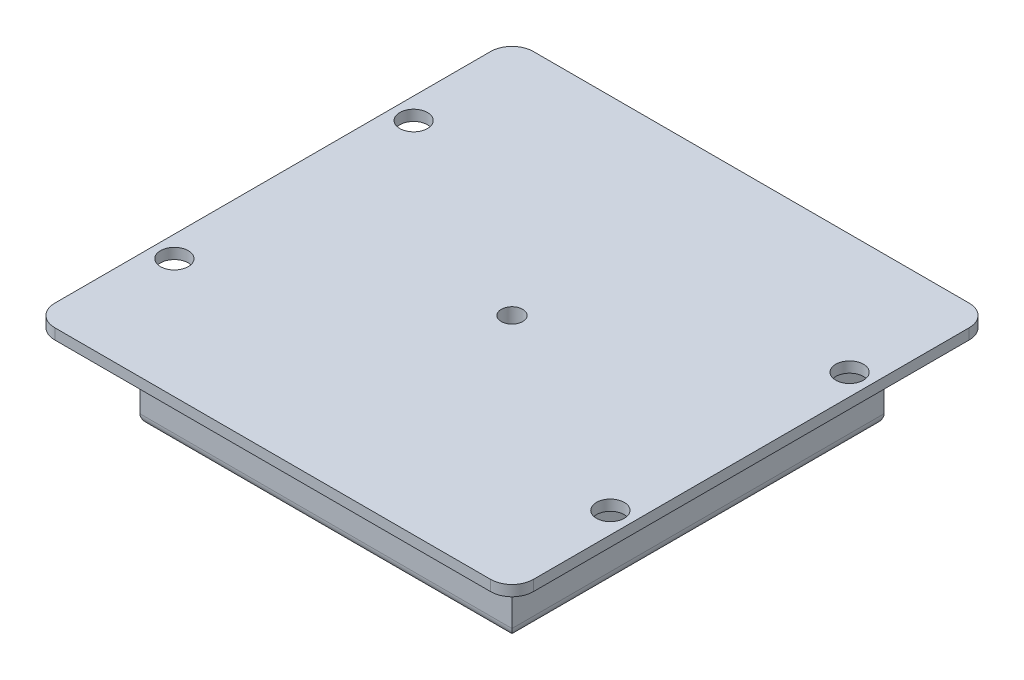
ISO-10303-21;
HEADER;
FILE_DESCRIPTION(('STEP AP214'),'2;1');
FILE_NAME('part.step','',(''),(''),'','','');
FILE_SCHEMA(('AUTOMOTIVE_DESIGN { 1 0 10303 214 1 1 1 1 }'));
ENDSEC;
DATA;
#1=APPLICATION_CONTEXT('core data for automotive mechanical design processes');
#2=APPLICATION_PROTOCOL_DEFINITION('international standard','automotive_design',2000,#1);
#3=PRODUCT_CONTEXT('',#1,'mechanical');
#4=PRODUCT('Part','Part','',(#3));
#5=PRODUCT_RELATED_PRODUCT_CATEGORY('part','',(#4));
#6=PRODUCT_DEFINITION_FORMATION('','',#4);
#7=PRODUCT_DEFINITION_CONTEXT('part definition',#1,'design');
#8=PRODUCT_DEFINITION('design','',#6,#7);
#9=PRODUCT_DEFINITION_SHAPE('','',#8);
#10=(LENGTH_UNIT() NAMED_UNIT(*) SI_UNIT(.MILLI.,.METRE.));
#11=(NAMED_UNIT(*) PLANE_ANGLE_UNIT() SI_UNIT($,.RADIAN.));
#12=(NAMED_UNIT(*) SI_UNIT($,.STERADIAN.) SOLID_ANGLE_UNIT());
#13=UNCERTAINTY_MEASURE_WITH_UNIT(LENGTH_MEASURE(1.E-05),#10,'distance_accuracy_value','');
#14=(GEOMETRIC_REPRESENTATION_CONTEXT(3) GLOBAL_UNCERTAINTY_ASSIGNED_CONTEXT((#13)) GLOBAL_UNIT_ASSIGNED_CONTEXT((#10,
#11,#12)) REPRESENTATION_CONTEXT('',''));
#15=CARTESIAN_POINT('',(0.,0.,0.));
#16=DIRECTION('',(0.,0.,1.));
#17=DIRECTION('',(1.,0.,0.));
#18=AXIS2_PLACEMENT_3D('',#15,#16,#17);
#19=CARTESIAN_POINT('',(0.,0.,0.));
#20=DIRECTION('',(0.,-1.,0.));
#21=DIRECTION('',(0.,0.,-1.));
#22=AXIS2_PLACEMENT_3D('',#19,#20,#21);
#23=PLANE('',#22);
#24=CARTESIAN_POINT('',(-52.07,0.,28.575));
#25=DIRECTION('',(0.,-1.,0.));
#26=DIRECTION('',(0.,0.,-1.));
#27=AXIS2_PLACEMENT_3D('',#24,#25,#26);
#28=CIRCLE('',#27,3.31469999999999);
#29=CARTESIAN_POINT('',(-52.07,0.,25.2603));
#30=VERTEX_POINT('',#29);
#31=EDGE_CURVE('E209',#30,#30,#28,.T.);
#32=ORIENTED_EDGE('',*,*,#31,.F.);
#33=EDGE_LOOP('',(#32));
#34=FACE_BOUND('',#33,.T.);
#35=CARTESIAN_POINT('',(-52.07,0.,-28.575));
#36=DIRECTION('',(0.,-1.,0.));
#37=DIRECTION('',(0.,0.,-1.));
#38=AXIS2_PLACEMENT_3D('',#35,#36,#37);
#39=CIRCLE('',#38,3.31469999999999);
#40=CARTESIAN_POINT('',(-52.07,0.,-31.8897));
#41=VERTEX_POINT('',#40);
#42=EDGE_CURVE('E216',#41,#41,#39,.T.);
#43=ORIENTED_EDGE('',*,*,#42,.F.);
#44=EDGE_LOOP('',(#43));
#45=FACE_BOUND('',#44,.T.);
#46=CARTESIAN_POINT('',(52.07,0.,28.575));
#47=DIRECTION('',(0.,-1.,0.));
#48=DIRECTION('',(0.,0.,-1.));
#49=AXIS2_PLACEMENT_3D('',#46,#47,#48);
#50=CIRCLE('',#49,3.31469999999999);
#51=CARTESIAN_POINT('',(52.07,0.,25.2603));
#52=VERTEX_POINT('',#51);
#53=EDGE_CURVE('E222',#52,#52,#50,.T.);
#54=ORIENTED_EDGE('',*,*,#53,.F.);
#55=EDGE_LOOP('',(#54));
#56=FACE_BOUND('',#55,.T.);
#57=CARTESIAN_POINT('',(52.07,0.,-28.575));
#58=DIRECTION('',(0.,-1.,0.));
#59=DIRECTION('',(0.,0.,-1.));
#60=AXIS2_PLACEMENT_3D('',#57,#58,#59);
#61=CIRCLE('',#60,3.31469999999999);
#62=CARTESIAN_POINT('',(52.07,0.,-31.8897));
#63=VERTEX_POINT('',#62);
#64=EDGE_CURVE('E228',#63,#63,#61,.T.);
#65=ORIENTED_EDGE('',*,*,#64,.F.);
#66=EDGE_LOOP('',(#65));
#67=FACE_BOUND('',#66,.T.);
#68=DIRECTION('',(0.,0.,1.));
#69=VECTOR('',#68,1.);
#70=CARTESIAN_POINT('',(-57.15,0.,-57.15));
#71=LINE('',#70,#69);
#72=CARTESIAN_POINT('',(-57.15,0.,6.35));
#73=VERTEX_POINT('',#72);
#74=CARTESIAN_POINT('',(-57.15,0.,52.07));
#75=VERTEX_POINT('',#74);
#76=EDGE_CURVE('E256',#73,#75,#71,.T.);
#77=ORIENTED_EDGE('',*,*,#76,.F.);
#78=DIRECTION('',(1.,0.,0.));
#79=VECTOR('',#78,1.);
#80=CARTESIAN_POINT('',(-57.15,0.,6.35));
#81=LINE('',#80,#79);
#82=CARTESIAN_POINT('',(-44.45,0.,6.35));
#83=VERTEX_POINT('',#82);
#84=EDGE_CURVE('E203',#73,#83,#81,.T.);
#85=ORIENTED_EDGE('',*,*,#84,.T.);
#86=DIRECTION('',(0.,0.,-1.));
#87=VECTOR('',#86,1.);
#88=CARTESIAN_POINT('',(-44.45,0.,44.45));
#89=LINE('',#88,#87);
#90=CARTESIAN_POINT('',(-44.45,0.,44.45));
#91=VERTEX_POINT('',#90);
#92=EDGE_CURVE('E235',#91,#83,#89,.T.);
#93=ORIENTED_EDGE('',*,*,#92,.F.);
#94=DIRECTION('',(1.,0.,0.));
#95=VECTOR('',#94,1.);
#96=CARTESIAN_POINT('',(-44.45,0.,44.45));
#97=LINE('',#96,#95);
#98=CARTESIAN_POINT('',(44.45,0.,44.45));
#99=VERTEX_POINT('',#98);
#100=EDGE_CURVE('E244',#91,#99,#97,.T.);
#101=ORIENTED_EDGE('',*,*,#100,.T.);
#102=DIRECTION('',(0.,0.,-1.));
#103=VECTOR('',#102,1.);
#104=CARTESIAN_POINT('',(44.45,0.,44.45));
#105=LINE('',#104,#103);
#106=CARTESIAN_POINT('',(44.45,0.,-44.45));
#107=VERTEX_POINT('',#106);
#108=EDGE_CURVE('E241',#99,#107,#105,.T.);
#109=ORIENTED_EDGE('',*,*,#108,.T.);
#110=DIRECTION('',(1.,0.,0.));
#111=VECTOR('',#110,1.);
#112=CARTESIAN_POINT('',(-44.45,0.,-44.45));
#113=LINE('',#112,#111);
#114=CARTESIAN_POINT('',(-44.45,0.,-44.45));
#115=VERTEX_POINT('',#114);
#116=EDGE_CURVE('E238',#115,#107,#113,.T.);
#117=ORIENTED_EDGE('',*,*,#116,.F.);
#118=CARTESIAN_POINT('',(-44.45,0.,-6.35));
#119=VERTEX_POINT('',#118);
#120=EDGE_CURVE('E234',#119,#115,#89,.T.);
#121=ORIENTED_EDGE('',*,*,#120,.F.);
#122=DIRECTION('',(1.,0.,0.));
#123=VECTOR('',#122,1.);
#124=CARTESIAN_POINT('',(-57.15,0.,-6.35));
#125=LINE('',#124,#123);
#126=CARTESIAN_POINT('',(-57.15,0.,-6.35));
#127=VERTEX_POINT('',#126);
#128=EDGE_CURVE('E52',#127,#119,#125,.T.);
#129=ORIENTED_EDGE('',*,*,#128,.F.);
#130=CARTESIAN_POINT('',(-57.15,0.,-52.07));
#131=VERTEX_POINT('',#130);
#132=EDGE_CURVE('E270',#131,#127,#71,.T.);
#133=ORIENTED_EDGE('',*,*,#132,.F.);
#134=CARTESIAN_POINT('',(-52.07,0.,-52.07));
#135=DIRECTION('',(0.,-1.,0.));
#136=DIRECTION('',(0.,0.,-1.));
#137=AXIS2_PLACEMENT_3D('',#134,#135,#136);
#138=CIRCLE('',#137,5.08);
#139=CARTESIAN_POINT('',(-52.07,0.,-57.15));
#140=VERTEX_POINT('',#139);
#141=EDGE_CURVE('E317',#131,#140,#138,.T.);
#142=ORIENTED_EDGE('',*,*,#141,.T.);
#143=DIRECTION('',(-1.,0.,0.));
#144=VECTOR('',#143,1.);
#145=CARTESIAN_POINT('',(57.15,0.,-57.15));
#146=LINE('',#145,#144);
#147=CARTESIAN_POINT('',(52.07,0.,-57.15));
#148=VERTEX_POINT('',#147);
#149=EDGE_CURVE('E261',#148,#140,#146,.T.);
#150=ORIENTED_EDGE('',*,*,#149,.F.);
#151=CARTESIAN_POINT('',(52.07,0.,-52.07));
#152=DIRECTION('',(0.,-1.,0.));
#153=DIRECTION('',(0.,0.,-1.));
#154=AXIS2_PLACEMENT_3D('',#151,#152,#153);
#155=CIRCLE('',#154,5.08);
#156=CARTESIAN_POINT('',(57.15,0.,-52.07));
#157=VERTEX_POINT('',#156);
#158=EDGE_CURVE('E310',#148,#157,#155,.T.);
#159=ORIENTED_EDGE('',*,*,#158,.T.);
#160=DIRECTION('',(0.,0.,-1.));
#161=VECTOR('',#160,1.);
#162=CARTESIAN_POINT('',(57.15,0.,-57.15));
#163=LINE('',#162,#161);
#164=CARTESIAN_POINT('',(57.15,0.,52.07));
#165=VERTEX_POINT('',#164);
#166=EDGE_CURVE('E276',#165,#157,#163,.T.);
#167=ORIENTED_EDGE('',*,*,#166,.F.);
#168=CARTESIAN_POINT('',(52.07,0.,52.07));
#169=DIRECTION('',(0.,-1.,0.));
#170=DIRECTION('',(0.,0.,-1.));
#171=AXIS2_PLACEMENT_3D('',#168,#169,#170);
#172=CIRCLE('',#171,5.08);
#173=CARTESIAN_POINT('',(52.07,0.,57.15));
#174=VERTEX_POINT('',#173);
#175=EDGE_CURVE('E312',#165,#174,#172,.T.);
#176=ORIENTED_EDGE('',*,*,#175,.T.);
#177=DIRECTION('',(1.,0.,0.));
#178=VECTOR('',#177,1.);
#179=CARTESIAN_POINT('',(57.15,0.,57.15));
#180=LINE('',#179,#178);
#181=CARTESIAN_POINT('',(-52.07,0.,57.15));
#182=VERTEX_POINT('',#181);
#183=EDGE_CURVE('E273',#182,#174,#180,.T.);
#184=ORIENTED_EDGE('',*,*,#183,.F.);
#185=CARTESIAN_POINT('',(-52.07,0.,52.07));
#186=DIRECTION('',(0.,-1.,0.));
#187=DIRECTION('',(0.,0.,-1.));
#188=AXIS2_PLACEMENT_3D('',#185,#186,#187);
#189=CIRCLE('',#188,5.08);
#190=EDGE_CURVE('E314',#182,#75,#189,.T.);
#191=ORIENTED_EDGE('',*,*,#190,.T.);
#192=EDGE_LOOP('',(#77,#85,#93,#101,#109,#117,#121,#129,#133,#142,#150,#159,#167,#176,#184,#191));
#193=FACE_BOUND('',#192,.T.);
#194=ADVANCED_FACE('F37',(#34,#45,#56,#67,#193),#23,.T.);
#195=CARTESIAN_POINT('',(-44.45,-20.32,44.45));
#196=DIRECTION('',(1.,0.,0.));
#197=DIRECTION('',(0.,0.,-1.));
#198=AXIS2_PLACEMENT_3D('',#195,#196,#197);
#199=PLANE('',#198);
#200=DIRECTION('',(0.,1.,0.));
#201=VECTOR('',#200,1.);
#202=CARTESIAN_POINT('',(-44.45,0.,6.35));
#203=LINE('',#202,#201);
#204=CARTESIAN_POINT('',(-44.45,-8.89,6.35));
#205=VERTEX_POINT('',#204);
#206=EDGE_CURVE('E198',#205,#83,#203,.T.);
#207=ORIENTED_EDGE('',*,*,#206,.F.);
#208=CARTESIAN_POINT('',(-44.45,-8.89,0.));
#209=DIRECTION('',(-1.,0.,0.));
#210=DIRECTION('',(0.,0.,1.));
#211=AXIS2_PLACEMENT_3D('',#208,#209,#210);
#212=CIRCLE('',#211,6.35);
#213=CARTESIAN_POINT('',(-44.45,-8.89,-6.35));
#214=VERTEX_POINT('',#213);
#215=EDGE_CURVE('E185',#214,#205,#212,.T.);
#216=ORIENTED_EDGE('',*,*,#215,.F.);
#217=DIRECTION('',(0.,1.,0.));
#218=VECTOR('',#217,1.);
#219=CARTESIAN_POINT('',(-44.45,0.,-6.35));
#220=LINE('',#219,#218);
#221=EDGE_CURVE('E191',#214,#119,#220,.T.);
#222=ORIENTED_EDGE('',*,*,#221,.T.);
#223=ORIENTED_EDGE('',*,*,#120,.T.);
#224=DIRECTION('',(0.,1.,0.));
#225=VECTOR('',#224,1.);
#226=CARTESIAN_POINT('',(-44.45,-20.32,-44.45));
#227=LINE('',#226,#225);
#228=CARTESIAN_POINT('',(-44.45,-17.78,-44.45));
#229=VERTEX_POINT('',#228);
#230=EDGE_CURVE('E253',#229,#115,#227,.T.);
#231=ORIENTED_EDGE('',*,*,#230,.F.);
#232=DIRECTION('',(0.,0.,-1.));
#233=VECTOR('',#232,1.);
#234=CARTESIAN_POINT('',(-44.45,-17.78,44.45));
#235=LINE('',#234,#233);
#236=CARTESIAN_POINT('',(-44.45,-17.78,44.45));
#237=VERTEX_POINT('',#236);
#238=EDGE_CURVE('E288',#229,#237,#235,.F.);
#239=ORIENTED_EDGE('',*,*,#238,.T.);
#240=DIRECTION('',(0.,1.,0.));
#241=VECTOR('',#240,1.);
#242=CARTESIAN_POINT('',(-44.45,-20.32,44.45));
#243=LINE('',#242,#241);
#244=EDGE_CURVE('E247',#237,#91,#243,.T.);
#245=ORIENTED_EDGE('',*,*,#244,.T.);
#246=ORIENTED_EDGE('',*,*,#92,.T.);
#247=EDGE_LOOP('',(#207,#216,#222,#223,#231,#239,#245,#246));
#248=FACE_BOUND('',#247,.T.);
#249=ADVANCED_FACE('F382',(#248),#199,.F.);
#250=CARTESIAN_POINT('',(-57.15,2.54,-57.15));
#251=DIRECTION('',(1.,0.,0.));
#252=DIRECTION('',(0.,0.,-1.));
#253=AXIS2_PLACEMENT_3D('',#250,#251,#252);
#254=PLANE('',#253);
#255=CARTESIAN_POINT('',(-57.15,-8.89,0.));
#256=DIRECTION('',(-1.,0.,0.));
#257=DIRECTION('',(0.,0.,1.));
#258=AXIS2_PLACEMENT_3D('',#255,#256,#257);
#259=CIRCLE('',#258,3.81);
#260=CARTESIAN_POINT('',(-57.15,-8.89,3.81));
#261=VERTEX_POINT('',#260);
#262=EDGE_CURVE('E175',#261,#261,#259,.T.);
#263=ORIENTED_EDGE('',*,*,#262,.F.);
#264=EDGE_LOOP('',(#263));
#265=FACE_BOUND('',#264,.T.);
#266=DIRECTION('',(0.,0.,1.));
#267=VECTOR('',#266,1.);
#268=CARTESIAN_POINT('',(-57.15,2.54,-57.15));
#269=LINE('',#268,#267);
#270=CARTESIAN_POINT('',(-57.15,2.54,-52.07));
#271=VERTEX_POINT('',#270);
#272=CARTESIAN_POINT('',(-57.15,2.54,52.07));
#273=VERTEX_POINT('',#272);
#274=EDGE_CURVE('E257',#271,#273,#269,.T.);
#275=ORIENTED_EDGE('',*,*,#274,.F.);
#276=DIRECTION('',(0.,-1.,0.));
#277=VECTOR('',#276,1.);
#278=CARTESIAN_POINT('',(-57.15,2.54,-52.07));
#279=LINE('',#278,#277);
#280=EDGE_CURVE('E307',#271,#131,#279,.T.);
#281=ORIENTED_EDGE('',*,*,#280,.T.);
#282=ORIENTED_EDGE('',*,*,#132,.T.);
#283=DIRECTION('',(0.,1.,0.));
#284=VECTOR('',#283,1.);
#285=CARTESIAN_POINT('',(-57.15,0.,-6.35));
#286=LINE('',#285,#284);
#287=CARTESIAN_POINT('',(-57.15,-8.89,-6.35));
#288=VERTEX_POINT('',#287);
#289=EDGE_CURVE('E193',#288,#127,#286,.T.);
#290=ORIENTED_EDGE('',*,*,#289,.F.);
#291=CARTESIAN_POINT('',(-57.15,-8.89,0.));
#292=DIRECTION('',(-1.,0.,0.));
#293=DIRECTION('',(0.,0.,1.));
#294=AXIS2_PLACEMENT_3D('',#291,#292,#293);
#295=CIRCLE('',#294,6.35);
#296=CARTESIAN_POINT('',(-57.15,-8.89,6.35));
#297=VERTEX_POINT('',#296);
#298=EDGE_CURVE('E187',#288,#297,#295,.T.);
#299=ORIENTED_EDGE('',*,*,#298,.T.);
#300=DIRECTION('',(0.,1.,0.));
#301=VECTOR('',#300,1.);
#302=CARTESIAN_POINT('',(-57.15,0.,6.35));
#303=LINE('',#302,#301);
#304=EDGE_CURVE('E190',#297,#73,#303,.T.);
#305=ORIENTED_EDGE('',*,*,#304,.T.);
#306=ORIENTED_EDGE('',*,*,#76,.T.);
#307=DIRECTION('',(0.,-1.,0.));
#308=VECTOR('',#307,1.);
#309=CARTESIAN_POINT('',(-57.15,2.54,52.07));
#310=LINE('',#309,#308);
#311=EDGE_CURVE('E297',#75,#273,#310,.F.);
#312=ORIENTED_EDGE('',*,*,#311,.T.);
#313=EDGE_LOOP('',(#275,#281,#282,#290,#299,#305,#306,#312));
#314=FACE_BOUND('',#313,.T.);
#315=ADVANCED_FACE('F370',(#265,#314),#254,.F.);
#316=CARTESIAN_POINT('',(57.15,2.54,57.15));
#317=DIRECTION('',(0.,0.,-1.));
#318=DIRECTION('',(-1.,0.,0.));
#319=AXIS2_PLACEMENT_3D('',#316,#317,#318);
#320=PLANE('',#319);
#321=DIRECTION('',(1.,0.,0.));
#322=VECTOR('',#321,1.);
#323=CARTESIAN_POINT('',(57.15,2.54,57.15));
#324=LINE('',#323,#322);
#325=CARTESIAN_POINT('',(-52.07,2.54,57.15));
#326=VERTEX_POINT('',#325);
#327=CARTESIAN_POINT('',(52.07,2.54,57.15));
#328=VERTEX_POINT('',#327);
#329=EDGE_CURVE('E260',#326,#328,#324,.T.);
#330=ORIENTED_EDGE('',*,*,#329,.F.);
#331=DIRECTION('',(0.,-1.,0.));
#332=VECTOR('',#331,1.);
#333=CARTESIAN_POINT('',(-52.07,2.54,57.15));
#334=LINE('',#333,#332);
#335=EDGE_CURVE('E334',#326,#182,#334,.T.);
#336=ORIENTED_EDGE('',*,*,#335,.T.);
#337=ORIENTED_EDGE('',*,*,#183,.T.);
#338=DIRECTION('',(0.,-1.,0.));
#339=VECTOR('',#338,1.);
#340=CARTESIAN_POINT('',(52.07,2.54,57.15));
#341=LINE('',#340,#339);
#342=EDGE_CURVE('E332',#174,#328,#341,.F.);
#343=ORIENTED_EDGE('',*,*,#342,.T.);
#344=EDGE_LOOP('',(#330,#336,#337,#343));
#345=FACE_BOUND('',#344,.T.);
#346=ADVANCED_FACE('F340',(#345),#320,.F.);
#347=CARTESIAN_POINT('',(57.15,2.54,-57.15));
#348=DIRECTION('',(-1.,0.,0.));
#349=DIRECTION('',(0.,0.,1.));
#350=AXIS2_PLACEMENT_3D('',#347,#348,#349);
#351=PLANE('',#350);
#352=DIRECTION('',(0.,0.,-1.));
#353=VECTOR('',#352,1.);
#354=CARTESIAN_POINT('',(57.15,2.54,-57.15));
#355=LINE('',#354,#353);
#356=CARTESIAN_POINT('',(57.15,2.54,52.07));
#357=VERTEX_POINT('',#356);
#358=CARTESIAN_POINT('',(57.15,2.54,-52.07));
#359=VERTEX_POINT('',#358);
#360=EDGE_CURVE('E264',#357,#359,#355,.T.);
#361=ORIENTED_EDGE('',*,*,#360,.F.);
#362=DIRECTION('',(0.,-1.,0.));
#363=VECTOR('',#362,1.);
#364=CARTESIAN_POINT('',(57.15,2.54,52.07));
#365=LINE('',#364,#363);
#366=EDGE_CURVE('E11',#357,#165,#365,.T.);
#367=ORIENTED_EDGE('',*,*,#366,.T.);
#368=ORIENTED_EDGE('',*,*,#166,.T.);
#369=DIRECTION('',(0.,-1.,0.));
#370=VECTOR('',#369,1.);
#371=CARTESIAN_POINT('',(57.15,2.54,-52.07));
#372=LINE('',#371,#370);
#373=EDGE_CURVE('E45',#157,#359,#372,.F.);
#374=ORIENTED_EDGE('',*,*,#373,.T.);
#375=EDGE_LOOP('',(#361,#367,#368,#374));
#376=FACE_BOUND('',#375,.T.);
#377=ADVANCED_FACE('F352',(#376),#351,.F.);
#378=CARTESIAN_POINT('',(57.15,2.54,-57.15));
#379=DIRECTION('',(0.,0.,1.));
#380=DIRECTION('',(1.,0.,0.));
#381=AXIS2_PLACEMENT_3D('',#378,#379,#380);
#382=PLANE('',#381);
#383=ORIENTED_EDGE('',*,*,#149,.T.);
#384=DIRECTION('',(0.,-1.,0.));
#385=VECTOR('',#384,1.);
#386=CARTESIAN_POINT('',(-52.07,2.54,-57.15));
#387=LINE('',#386,#385);
#388=CARTESIAN_POINT('',(-52.07,2.54,-57.15));
#389=VERTEX_POINT('',#388);
#390=EDGE_CURVE('E322',#140,#389,#387,.F.);
#391=ORIENTED_EDGE('',*,*,#390,.T.);
#392=DIRECTION('',(-1.,0.,0.));
#393=VECTOR('',#392,1.);
#394=CARTESIAN_POINT('',(57.15,2.54,-57.15));
#395=LINE('',#394,#393);
#396=CARTESIAN_POINT('',(52.07,2.54,-57.15));
#397=VERTEX_POINT('',#396);
#398=EDGE_CURVE('E266',#397,#389,#395,.T.);
#399=ORIENTED_EDGE('',*,*,#398,.F.);
#400=DIRECTION('',(0.,-1.,0.));
#401=VECTOR('',#400,1.);
#402=CARTESIAN_POINT('',(52.07,2.54,-57.15));
#403=LINE('',#402,#401);
#404=EDGE_CURVE('E319',#397,#148,#403,.T.);
#405=ORIENTED_EDGE('',*,*,#404,.T.);
#406=EDGE_LOOP('',(#383,#391,#399,#405));
#407=FACE_BOUND('',#406,.T.);
#408=ADVANCED_FACE('F361',(#407),#382,.F.);
#409=CARTESIAN_POINT('',(0.,2.54,0.));
#410=DIRECTION('',(0.,-1.,0.));
#411=DIRECTION('',(0.,0.,-1.));
#412=AXIS2_PLACEMENT_3D('',#409,#410,#411);
#413=PLANE('',#412);
#414=CARTESIAN_POINT('',(0.,2.54,0.));
#415=DIRECTION('',(0.,1.,0.));
#416=DIRECTION('',(0.,0.,1.));
#417=AXIS2_PLACEMENT_3D('',#414,#415,#416);
#418=CIRCLE('',#417,2.55269999999999);
#419=CARTESIAN_POINT('',(0.,2.54,2.55269999999999));
#420=VERTEX_POINT('',#419);
#421=EDGE_CURVE('E176',#420,#420,#418,.T.);
#422=ORIENTED_EDGE('',*,*,#421,.F.);
#423=EDGE_LOOP('',(#422));
#424=FACE_BOUND('',#423,.T.);
#425=CARTESIAN_POINT('',(-52.07,2.54,28.575));
#426=DIRECTION('',(0.,-1.,0.));
#427=DIRECTION('',(0.,0.,-1.));
#428=AXIS2_PLACEMENT_3D('',#425,#426,#427);
#429=CIRCLE('',#428,3.3147);
#430=CARTESIAN_POINT('',(-52.07,2.54,25.2603));
#431=VERTEX_POINT('',#430);
#432=EDGE_CURVE('E212',#431,#431,#429,.T.);
#433=ORIENTED_EDGE('',*,*,#432,.T.);
#434=EDGE_LOOP('',(#433));
#435=FACE_BOUND('',#434,.T.);
#436=CARTESIAN_POINT('',(-52.07,2.54,-28.575));
#437=DIRECTION('',(0.,-1.,0.));
#438=DIRECTION('',(0.,0.,-1.));
#439=AXIS2_PLACEMENT_3D('',#436,#437,#438);
#440=CIRCLE('',#439,3.3147);
#441=CARTESIAN_POINT('',(-52.07,2.54,-31.8897));
#442=VERTEX_POINT('',#441);
#443=EDGE_CURVE('E219',#442,#442,#440,.T.);
#444=ORIENTED_EDGE('',*,*,#443,.T.);
#445=EDGE_LOOP('',(#444));
#446=FACE_BOUND('',#445,.T.);
#447=CARTESIAN_POINT('',(52.07,2.54,28.575));
#448=DIRECTION('',(0.,-1.,0.));
#449=DIRECTION('',(0.,0.,-1.));
#450=AXIS2_PLACEMENT_3D('',#447,#448,#449);
#451=CIRCLE('',#450,3.3147);
#452=CARTESIAN_POINT('',(52.07,2.54,25.2603));
#453=VERTEX_POINT('',#452);
#454=EDGE_CURVE('E225',#453,#453,#451,.T.);
#455=ORIENTED_EDGE('',*,*,#454,.T.);
#456=EDGE_LOOP('',(#455));
#457=FACE_BOUND('',#456,.T.);
#458=CARTESIAN_POINT('',(52.07,2.54,-28.575));
#459=DIRECTION('',(0.,-1.,0.));
#460=DIRECTION('',(0.,0.,-1.));
#461=AXIS2_PLACEMENT_3D('',#458,#459,#460);
#462=CIRCLE('',#461,3.3147);
#463=CARTESIAN_POINT('',(52.07,2.54,-31.8897));
#464=VERTEX_POINT('',#463);
#465=EDGE_CURVE('E231',#464,#464,#462,.T.);
#466=ORIENTED_EDGE('',*,*,#465,.T.);
#467=EDGE_LOOP('',(#466));
#468=FACE_BOUND('',#467,.T.);
#469=ORIENTED_EDGE('',*,*,#398,.T.);
#470=CARTESIAN_POINT('',(-52.07,2.54,-52.07));
#471=DIRECTION('',(0.,-1.,0.));
#472=DIRECTION('',(0.,0.,-1.));
#473=AXIS2_PLACEMENT_3D('',#470,#471,#472);
#474=CIRCLE('',#473,5.08);
#475=EDGE_CURVE('E330',#389,#271,#474,.F.);
#476=ORIENTED_EDGE('',*,*,#475,.T.);
#477=ORIENTED_EDGE('',*,*,#274,.T.);
#478=CARTESIAN_POINT('',(-52.07,2.54,52.07));
#479=DIRECTION('',(0.,-1.,0.));
#480=DIRECTION('',(0.,0.,-1.));
#481=AXIS2_PLACEMENT_3D('',#478,#479,#480);
#482=CIRCLE('',#481,5.08);
#483=EDGE_CURVE('E328',#273,#326,#482,.F.);
#484=ORIENTED_EDGE('',*,*,#483,.T.);
#485=ORIENTED_EDGE('',*,*,#329,.T.);
#486=CARTESIAN_POINT('',(52.07,2.54,52.07));
#487=DIRECTION('',(0.,-1.,0.));
#488=DIRECTION('',(0.,0.,-1.));
#489=AXIS2_PLACEMENT_3D('',#486,#487,#488);
#490=CIRCLE('',#489,5.08);
#491=EDGE_CURVE('E326',#328,#357,#490,.F.);
#492=ORIENTED_EDGE('',*,*,#491,.T.);
#493=ORIENTED_EDGE('',*,*,#360,.T.);
#494=CARTESIAN_POINT('',(52.07,2.54,-52.07));
#495=DIRECTION('',(0.,-1.,0.));
#496=DIRECTION('',(0.,0.,-1.));
#497=AXIS2_PLACEMENT_3D('',#494,#495,#496);
#498=CIRCLE('',#497,5.08);
#499=EDGE_CURVE('E324',#359,#397,#498,.F.);
#500=ORIENTED_EDGE('',*,*,#499,.T.);
#501=EDGE_LOOP('',(#469,#476,#477,#484,#485,#492,#493,#500));
#502=FACE_BOUND('',#501,.T.);
#503=ADVANCED_FACE('F355',(#424,#435,#446,#457,#468,#502),#413,.F.);
#504=CARTESIAN_POINT('',(-44.45,-20.32,-44.45));
#505=DIRECTION('',(0.,0.,1.));
#506=DIRECTION('',(1.,0.,0.));
#507=AXIS2_PLACEMENT_3D('',#504,#505,#506);
#508=PLANE('',#507);
#509=DIRECTION('',(0.,1.,0.));
#510=VECTOR('',#509,1.);
#511=CARTESIAN_POINT('',(44.45,-20.32,-44.45));
#512=LINE('',#511,#510);
#513=CARTESIAN_POINT('',(44.45,-17.78,-44.45));
#514=VERTEX_POINT('',#513);
#515=EDGE_CURVE('E251',#514,#107,#512,.T.);
#516=ORIENTED_EDGE('',*,*,#515,.F.);
#517=DIRECTION('',(1.,0.,0.));
#518=VECTOR('',#517,1.);
#519=CARTESIAN_POINT('',(-44.45,-17.78,-44.45));
#520=LINE('',#519,#518);
#521=EDGE_CURVE('E295',#514,#229,#520,.F.);
#522=ORIENTED_EDGE('',*,*,#521,.T.);
#523=ORIENTED_EDGE('',*,*,#230,.T.);
#524=ORIENTED_EDGE('',*,*,#116,.T.);
#525=EDGE_LOOP('',(#516,#522,#523,#524));
#526=FACE_BOUND('',#525,.T.);
#527=ADVANCED_FACE('F434',(#526),#508,.F.);
#528=CARTESIAN_POINT('',(44.45,-20.32,44.45));
#529=DIRECTION('',(1.,0.,0.));
#530=DIRECTION('',(0.,0.,-1.));
#531=AXIS2_PLACEMENT_3D('',#528,#529,#530);
#532=PLANE('',#531);
#533=DIRECTION('',(0.,1.,0.));
#534=VECTOR('',#533,1.);
#535=CARTESIAN_POINT('',(44.45,-20.32,44.45));
#536=LINE('',#535,#534);
#537=CARTESIAN_POINT('',(44.45,-17.78,44.45));
#538=VERTEX_POINT('',#537);
#539=EDGE_CURVE('E249',#538,#99,#536,.T.);
#540=ORIENTED_EDGE('',*,*,#539,.F.);
#541=DIRECTION('',(0.,0.,-1.));
#542=VECTOR('',#541,1.);
#543=CARTESIAN_POINT('',(44.45,-17.78,44.45));
#544=LINE('',#543,#542);
#545=EDGE_CURVE('E293',#538,#514,#544,.T.);
#546=ORIENTED_EDGE('',*,*,#545,.T.);
#547=ORIENTED_EDGE('',*,*,#515,.T.);
#548=ORIENTED_EDGE('',*,*,#108,.F.);
#549=EDGE_LOOP('',(#540,#546,#547,#548));
#550=FACE_BOUND('',#549,.T.);
#551=ADVANCED_FACE('F450',(#550),#532,.T.);
#552=CARTESIAN_POINT('',(-44.45,-20.32,44.45));
#553=DIRECTION('',(0.,0.,1.));
#554=DIRECTION('',(1.,0.,0.));
#555=AXIS2_PLACEMENT_3D('',#552,#553,#554);
#556=PLANE('',#555);
#557=ORIENTED_EDGE('',*,*,#244,.F.);
#558=DIRECTION('',(1.,0.,0.));
#559=VECTOR('',#558,1.);
#560=CARTESIAN_POINT('',(-44.45,-17.78,44.45));
#561=LINE('',#560,#559);
#562=EDGE_CURVE('E291',#237,#538,#561,.T.);
#563=ORIENTED_EDGE('',*,*,#562,.T.);
#564=ORIENTED_EDGE('',*,*,#539,.T.);
#565=ORIENTED_EDGE('',*,*,#100,.F.);
#566=EDGE_LOOP('',(#557,#563,#564,#565));
#567=FACE_BOUND('',#566,.T.);
#568=ADVANCED_FACE('F446',(#567),#556,.T.);
#569=CARTESIAN_POINT('',(0.,-20.32,0.));
#570=DIRECTION('',(0.,-1.,0.));
#571=DIRECTION('',(0.,0.,-1.));
#572=AXIS2_PLACEMENT_3D('',#569,#570,#571);
#573=PLANE('',#572);
#574=DIRECTION('',(1.,0.,0.));
#575=VECTOR('',#574,1.);
#576=CARTESIAN_POINT('',(0.,-20.32,41.91));
#577=LINE('',#576,#575);
#578=CARTESIAN_POINT('',(41.91,-20.32,41.91));
#579=VERTEX_POINT('',#578);
#580=CARTESIAN_POINT('',(-41.91,-20.32,41.91));
#581=VERTEX_POINT('',#580);
#582=EDGE_CURVE('E283',#579,#581,#577,.F.);
#583=ORIENTED_EDGE('',*,*,#582,.T.);
#584=DIRECTION('',(0.,0.,-1.));
#585=VECTOR('',#584,1.);
#586=CARTESIAN_POINT('',(-41.91,-20.32,-44.45));
#587=LINE('',#586,#585);
#588=CARTESIAN_POINT('',(-41.91,-20.32,-41.91));
#589=VERTEX_POINT('',#588);
#590=EDGE_CURVE('E285',#581,#589,#587,.T.);
#591=ORIENTED_EDGE('',*,*,#590,.T.);
#592=DIRECTION('',(1.,0.,0.));
#593=VECTOR('',#592,1.);
#594=CARTESIAN_POINT('',(44.45,-20.32,-41.91));
#595=LINE('',#594,#593);
#596=CARTESIAN_POINT('',(41.91,-20.32,-41.91));
#597=VERTEX_POINT('',#596);
#598=EDGE_CURVE('E269',#589,#597,#595,.T.);
#599=ORIENTED_EDGE('',*,*,#598,.T.);
#600=DIRECTION('',(0.,0.,-1.));
#601=VECTOR('',#600,1.);
#602=CARTESIAN_POINT('',(41.91,-20.32,0.));
#603=LINE('',#602,#601);
#604=EDGE_CURVE('E281',#597,#579,#603,.F.);
#605=ORIENTED_EDGE('',*,*,#604,.T.);
#606=EDGE_LOOP('',(#583,#591,#599,#605));
#607=FACE_BOUND('',#606,.T.);
#608=ADVANCED_FACE('F485',(#607),#573,.T.);
#609=CARTESIAN_POINT('',(52.07,0.,-28.575));
#610=DIRECTION('',(0.,-1.,0.));
#611=DIRECTION('',(0.,0.,-1.));
#612=AXIS2_PLACEMENT_3D('',#609,#610,#611);
#613=CYLINDRICAL_SURFACE('',#612,3.31469999999999);
#614=ORIENTED_EDGE('',*,*,#465,.F.);
#615=EDGE_LOOP('',(#614));
#616=FACE_BOUND('',#615,.T.);
#617=ORIENTED_EDGE('',*,*,#64,.T.);
#618=EDGE_LOOP('',(#617));
#619=FACE_BOUND('',#618,.T.);
#620=ADVANCED_FACE('F481',(#616,#619),#613,.F.);
#621=CARTESIAN_POINT('',(52.07,0.,28.575));
#622=DIRECTION('',(0.,-1.,0.));
#623=DIRECTION('',(0.,0.,-1.));
#624=AXIS2_PLACEMENT_3D('',#621,#622,#623);
#625=CYLINDRICAL_SURFACE('',#624,3.31469999999999);
#626=ORIENTED_EDGE('',*,*,#454,.F.);
#627=EDGE_LOOP('',(#626));
#628=FACE_BOUND('',#627,.T.);
#629=ORIENTED_EDGE('',*,*,#53,.T.);
#630=EDGE_LOOP('',(#629));
#631=FACE_BOUND('',#630,.T.);
#632=ADVANCED_FACE('F477',(#628,#631),#625,.F.);
#633=CARTESIAN_POINT('',(-52.07,0.,-28.575));
#634=DIRECTION('',(0.,-1.,0.));
#635=DIRECTION('',(0.,0.,-1.));
#636=AXIS2_PLACEMENT_3D('',#633,#634,#635);
#637=CYLINDRICAL_SURFACE('',#636,3.31469999999999);
#638=ORIENTED_EDGE('',*,*,#443,.F.);
#639=EDGE_LOOP('',(#638));
#640=FACE_BOUND('',#639,.T.);
#641=ORIENTED_EDGE('',*,*,#42,.T.);
#642=EDGE_LOOP('',(#641));
#643=FACE_BOUND('',#642,.T.);
#644=ADVANCED_FACE('F421',(#640,#643),#637,.F.);
#645=CARTESIAN_POINT('',(-52.07,0.,28.575));
#646=DIRECTION('',(0.,-1.,0.));
#647=DIRECTION('',(0.,0.,-1.));
#648=AXIS2_PLACEMENT_3D('',#645,#646,#647);
#649=CYLINDRICAL_SURFACE('',#648,3.31469999999999);
#650=ORIENTED_EDGE('',*,*,#432,.F.);
#651=EDGE_LOOP('',(#650));
#652=FACE_BOUND('',#651,.T.);
#653=ORIENTED_EDGE('',*,*,#31,.T.);
#654=EDGE_LOOP('',(#653));
#655=FACE_BOUND('',#654,.T.);
#656=ADVANCED_FACE('F416',(#652,#655),#649,.F.);
#657=CARTESIAN_POINT('',(41.91,-17.78,44.45));
#658=DIRECTION('',(0.,0.,-1.));
#659=DIRECTION('',(-1.,0.,0.));
#660=AXIS2_PLACEMENT_3D('',#657,#658,#659);
#661=CYLINDRICAL_SURFACE('',#660,2.54);
#662=CARTESIAN_POINT('',(41.91,-17.78,-41.91));
#663=DIRECTION('',(-0.707106781186547,0.,-0.707106781186548));
#664=DIRECTION('',(-0.707106781186548,0.,0.707106781186547));
#665=AXIS2_PLACEMENT_3D('',#662,#663,#664);
#666=ELLIPSE('',#665,3.59210244842766,2.54);
#667=EDGE_CURVE('E301',#514,#597,#666,.T.);
#668=ORIENTED_EDGE('',*,*,#667,.F.);
#669=ORIENTED_EDGE('',*,*,#545,.F.);
#670=CARTESIAN_POINT('',(41.91,-17.78,41.91));
#671=DIRECTION('',(0.707106781186548,0.,-0.707106781186547));
#672=DIRECTION('',(-0.707106781186547,0.,-0.707106781186548));
#673=AXIS2_PLACEMENT_3D('',#670,#671,#672);
#674=ELLIPSE('',#673,3.59210244842766,2.54);
#675=EDGE_CURVE('E213',#579,#538,#674,.F.);
#676=ORIENTED_EDGE('',*,*,#675,.F.);
#677=ORIENTED_EDGE('',*,*,#604,.F.);
#678=EDGE_LOOP('',(#668,#669,#676,#677));
#679=FACE_BOUND('',#678,.T.);
#680=ADVANCED_FACE('F413',(#679),#661,.T.);
#681=CARTESIAN_POINT('',(-44.45,-17.78,41.91));
#682=DIRECTION('',(1.,0.,0.));
#683=DIRECTION('',(0.,0.,-1.));
#684=AXIS2_PLACEMENT_3D('',#681,#682,#683);
#685=CYLINDRICAL_SURFACE('',#684,2.54);
#686=ORIENTED_EDGE('',*,*,#675,.T.);
#687=ORIENTED_EDGE('',*,*,#562,.F.);
#688=CARTESIAN_POINT('',(-41.91,-17.78,41.91));
#689=DIRECTION('',(0.707106781186547,0.,0.707106781186548));
#690=DIRECTION('',(0.707106781186548,0.,-0.707106781186547));
#691=AXIS2_PLACEMENT_3D('',#688,#689,#690);
#692=ELLIPSE('',#691,3.59210244842766,2.54);
#693=EDGE_CURVE('E299',#581,#237,#692,.F.);
#694=ORIENTED_EDGE('',*,*,#693,.F.);
#695=ORIENTED_EDGE('',*,*,#582,.F.);
#696=EDGE_LOOP('',(#686,#687,#694,#695));
#697=FACE_BOUND('',#696,.T.);
#698=ADVANCED_FACE('F409',(#697),#685,.T.);
#699=CARTESIAN_POINT('',(0.,-17.78,-41.91));
#700=DIRECTION('',(-1.,0.,0.));
#701=DIRECTION('',(0.,0.,1.));
#702=AXIS2_PLACEMENT_3D('',#699,#700,#701);
#703=CYLINDRICAL_SURFACE('',#702,2.54);
#704=ORIENTED_EDGE('',*,*,#667,.T.);
#705=ORIENTED_EDGE('',*,*,#598,.F.);
#706=CARTESIAN_POINT('',(-41.91,-17.78,-41.91));
#707=DIRECTION('',(-0.707106781186548,0.,0.707106781186547));
#708=DIRECTION('',(-0.707106781186547,0.,-0.707106781186548));
#709=AXIS2_PLACEMENT_3D('',#706,#707,#708);
#710=ELLIPSE('',#709,3.59210244842766,2.54);
#711=EDGE_CURVE('E208',#229,#589,#710,.T.);
#712=ORIENTED_EDGE('',*,*,#711,.F.);
#713=ORIENTED_EDGE('',*,*,#521,.F.);
#714=EDGE_LOOP('',(#704,#705,#712,#713));
#715=FACE_BOUND('',#714,.T.);
#716=ADVANCED_FACE('F405',(#715),#703,.T.);
#717=CARTESIAN_POINT('',(-41.91,-17.78,0.));
#718=DIRECTION('',(0.,0.,1.));
#719=DIRECTION('',(1.,0.,0.));
#720=AXIS2_PLACEMENT_3D('',#717,#718,#719);
#721=CYLINDRICAL_SURFACE('',#720,2.54);
#722=ORIENTED_EDGE('',*,*,#693,.T.);
#723=ORIENTED_EDGE('',*,*,#238,.F.);
#724=ORIENTED_EDGE('',*,*,#711,.T.);
#725=ORIENTED_EDGE('',*,*,#590,.F.);
#726=EDGE_LOOP('',(#722,#723,#724,#725));
#727=FACE_BOUND('',#726,.T.);
#728=ADVANCED_FACE('F379',(#727),#721,.T.);
#729=CARTESIAN_POINT('',(-52.07,2.54,-52.07));
#730=DIRECTION('',(0.,-1.,0.));
#731=DIRECTION('',(0.,0.,-1.));
#732=AXIS2_PLACEMENT_3D('',#729,#730,#731);
#733=CYLINDRICAL_SURFACE('',#732,5.08);
#734=ORIENTED_EDGE('',*,*,#475,.F.);
#735=ORIENTED_EDGE('',*,*,#390,.F.);
#736=ORIENTED_EDGE('',*,*,#141,.F.);
#737=ORIENTED_EDGE('',*,*,#280,.F.);
#738=EDGE_LOOP('',(#734,#735,#736,#737));
#739=FACE_BOUND('',#738,.T.);
#740=ADVANCED_FACE('F367',(#739),#733,.T.);
#741=CARTESIAN_POINT('',(-52.07,2.54,52.07));
#742=DIRECTION('',(0.,-1.,0.));
#743=DIRECTION('',(0.,0.,-1.));
#744=AXIS2_PLACEMENT_3D('',#741,#742,#743);
#745=CYLINDRICAL_SURFACE('',#744,5.08);
#746=ORIENTED_EDGE('',*,*,#483,.F.);
#747=ORIENTED_EDGE('',*,*,#311,.F.);
#748=ORIENTED_EDGE('',*,*,#190,.F.);
#749=ORIENTED_EDGE('',*,*,#335,.F.);
#750=EDGE_LOOP('',(#746,#747,#748,#749));
#751=FACE_BOUND('',#750,.T.);
#752=ADVANCED_FACE('F372',(#751),#745,.T.);
#753=CARTESIAN_POINT('',(52.07,2.54,52.07));
#754=DIRECTION('',(0.,-1.,0.));
#755=DIRECTION('',(0.,0.,-1.));
#756=AXIS2_PLACEMENT_3D('',#753,#754,#755);
#757=CYLINDRICAL_SURFACE('',#756,5.08);
#758=ORIENTED_EDGE('',*,*,#491,.F.);
#759=ORIENTED_EDGE('',*,*,#342,.F.);
#760=ORIENTED_EDGE('',*,*,#175,.F.);
#761=ORIENTED_EDGE('',*,*,#366,.F.);
#762=EDGE_LOOP('',(#758,#759,#760,#761));
#763=FACE_BOUND('',#762,.T.);
#764=ADVANCED_FACE('F351',(#763),#757,.T.);
#765=CARTESIAN_POINT('',(52.07,2.54,-52.07));
#766=DIRECTION('',(0.,-1.,0.));
#767=DIRECTION('',(0.,0.,-1.));
#768=AXIS2_PLACEMENT_3D('',#765,#766,#767);
#769=CYLINDRICAL_SURFACE('',#768,5.08);
#770=ORIENTED_EDGE('',*,*,#499,.F.);
#771=ORIENTED_EDGE('',*,*,#373,.F.);
#772=ORIENTED_EDGE('',*,*,#158,.F.);
#773=ORIENTED_EDGE('',*,*,#404,.F.);
#774=EDGE_LOOP('',(#770,#771,#772,#773));
#775=FACE_BOUND('',#774,.T.);
#776=ADVANCED_FACE('F39',(#775),#769,.T.);
#777=CARTESIAN_POINT('',(-57.15,-8.89,0.));
#778=DIRECTION('',(1.,0.,0.));
#779=DIRECTION('',(0.,0.,-1.));
#780=AXIS2_PLACEMENT_3D('',#777,#778,#779);
#781=CYLINDRICAL_SURFACE('',#780,6.35);
#782=ORIENTED_EDGE('',*,*,#215,.T.);
#783=DIRECTION('',(1.,0.,0.));
#784=VECTOR('',#783,1.);
#785=CARTESIAN_POINT('',(-57.15,-8.89,6.35));
#786=LINE('',#785,#784);
#787=EDGE_CURVE('E206',#297,#205,#786,.T.);
#788=ORIENTED_EDGE('',*,*,#787,.F.);
#789=ORIENTED_EDGE('',*,*,#298,.F.);
#790=DIRECTION('',(1.,0.,0.));
#791=VECTOR('',#790,1.);
#792=CARTESIAN_POINT('',(-57.15,-8.89,-6.35));
#793=LINE('',#792,#791);
#794=EDGE_CURVE('E195',#288,#214,#793,.T.);
#795=ORIENTED_EDGE('',*,*,#794,.T.);
#796=EDGE_LOOP('',(#782,#788,#789,#795));
#797=FACE_BOUND('',#796,.T.);
#798=ADVANCED_FACE('F459',(#797),#781,.T.);
#799=CARTESIAN_POINT('',(-57.15,0.,6.35));
#800=DIRECTION('',(0.,0.,-1.));
#801=DIRECTION('',(-1.,0.,0.));
#802=AXIS2_PLACEMENT_3D('',#799,#800,#801);
#803=PLANE('',#802);
#804=ORIENTED_EDGE('',*,*,#206,.T.);
#805=ORIENTED_EDGE('',*,*,#84,.F.);
#806=ORIENTED_EDGE('',*,*,#304,.F.);
#807=ORIENTED_EDGE('',*,*,#787,.T.);
#808=EDGE_LOOP('',(#804,#805,#806,#807));
#809=FACE_BOUND('',#808,.T.);
#810=ADVANCED_FACE('F455',(#809),#803,.F.);
#811=CARTESIAN_POINT('',(-57.15,0.,-6.35));
#812=DIRECTION('',(0.,0.,-1.));
#813=DIRECTION('',(-1.,0.,0.));
#814=AXIS2_PLACEMENT_3D('',#811,#812,#813);
#815=PLANE('',#814);
#816=ORIENTED_EDGE('',*,*,#221,.F.);
#817=ORIENTED_EDGE('',*,*,#794,.F.);
#818=ORIENTED_EDGE('',*,*,#289,.T.);
#819=ORIENTED_EDGE('',*,*,#128,.T.);
#820=EDGE_LOOP('',(#816,#817,#818,#819));
#821=FACE_BOUND('',#820,.T.);
#822=ADVANCED_FACE('F460',(#821),#815,.T.);
#823=CARTESIAN_POINT('',(-44.45,-8.89,0.));
#824=DIRECTION('',(-1.,0.,0.));
#825=DIRECTION('',(0.,0.,1.));
#826=AXIS2_PLACEMENT_3D('',#823,#824,#825);
#827=CYLINDRICAL_SURFACE('',#826,3.81);
#828=CARTESIAN_POINT('',(-44.45,-8.89,0.));
#829=DIRECTION('',(-1.,0.,0.));
#830=DIRECTION('',(0.,0.,1.));
#831=AXIS2_PLACEMENT_3D('',#828,#829,#830);
#832=CIRCLE('',#831,3.81);
#833=CARTESIAN_POINT('',(-44.45,-8.89,3.81));
#834=VERTEX_POINT('',#833);
#835=EDGE_CURVE('E179',#834,#834,#832,.T.);
#836=ORIENTED_EDGE('',*,*,#835,.F.);
#837=EDGE_LOOP('',(#836));
#838=FACE_BOUND('',#837,.T.);
#839=ORIENTED_EDGE('',*,*,#262,.T.);
#840=EDGE_LOOP('',(#839));
#841=FACE_BOUND('',#840,.T.);
#842=ADVANCED_FACE('F462',(#838,#841),#827,.F.);
#843=CARTESIAN_POINT('',(-44.45,-8.89,0.));
#844=DIRECTION('',(-1.,0.,0.));
#845=DIRECTION('',(0.,0.,1.));
#846=AXIS2_PLACEMENT_3D('',#843,#844,#845);
#847=PLANE('',#846);
#848=ORIENTED_EDGE('',*,*,#835,.T.);
#849=EDGE_LOOP('',(#848));
#850=FACE_BOUND('',#849,.T.);
#851=ADVANCED_FACE('F169',(#850),#847,.T.);
#852=CARTESIAN_POINT('',(0.,-13.97,0.));
#853=DIRECTION('',(0.,1.,0.));
#854=DIRECTION('',(0.,0.,1.));
#855=AXIS2_PLACEMENT_3D('',#852,#853,#854);
#856=CONICAL_SURFACE('',#855,2.55269999999999,1.02974425867665);
#857=CARTESIAN_POINT('',(0.,-15.5038169021916,0.));
#858=VERTEX_POINT('',#857);
#859=VERTEX_LOOP('',#858);
#860=FACE_BOUND('',#859,.T.);
#861=CARTESIAN_POINT('',(0.,-13.97,0.));
#862=DIRECTION('',(0.,1.,0.));
#863=DIRECTION('',(0.,0.,1.));
#864=AXIS2_PLACEMENT_3D('',#861,#862,#863);
#865=CIRCLE('',#864,2.55269999999999);
#866=CARTESIAN_POINT('',(0.,-13.97,2.55269999999999));
#867=VERTEX_POINT('',#866);
#868=EDGE_CURVE('E173',#867,#867,#865,.T.);
#869=ORIENTED_EDGE('',*,*,#868,.T.);
#870=EDGE_LOOP('',(#869));
#871=FACE_BOUND('',#870,.T.);
#872=ADVANCED_FACE('F165',(#860,#871),#856,.F.);
#873=CARTESIAN_POINT('',(0.,2.54,0.));
#874=DIRECTION('',(0.,1.,0.));
#875=DIRECTION('',(0.,0.,1.));
#876=AXIS2_PLACEMENT_3D('',#873,#874,#875);
#877=CYLINDRICAL_SURFACE('',#876,2.55269999999999);
#878=ORIENTED_EDGE('',*,*,#868,.F.);
#879=EDGE_LOOP('',(#878));
#880=FACE_BOUND('',#879,.T.);
#881=ORIENTED_EDGE('',*,*,#421,.T.);
#882=EDGE_LOOP('',(#881));
#883=FACE_BOUND('',#882,.T.);
#884=ADVANCED_FACE('F168',(#880,#883),#877,.F.);
#885=CLOSED_SHELL('',(#194,#249,#315,#346,#377,#408,#503,#527,#551,#568,#608,#620,#632,#644,
#656,#680,#698,#716,#728,#740,#752,#764,#776,#798,#810,#822,#842,#851,#872,#884));
#886=MANIFOLD_SOLID_BREP('B2',#885);
#887=ADVANCED_BREP_SHAPE_REPRESENTATION('',(#18,#886),#14);
#888=SHAPE_DEFINITION_REPRESENTATION(#9,#887);
ENDSEC;
END-ISO-10303-21;
